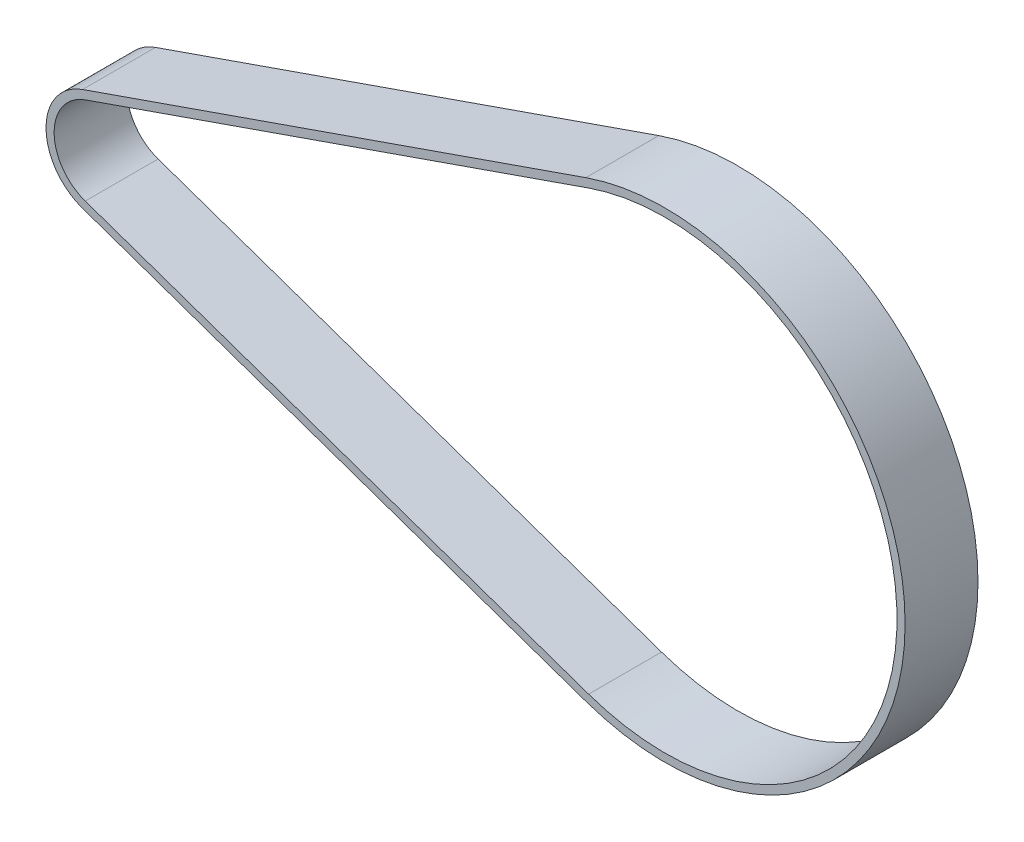
ISO-10303-21;
HEADER;
FILE_DESCRIPTION(('STEP AP214'),'2;1');
FILE_NAME('part.step','',(''),(''),'','','');
FILE_SCHEMA(('AUTOMOTIVE_DESIGN { 1 0 10303 214 1 1 1 1 }'));
ENDSEC;
DATA;
#1=APPLICATION_CONTEXT('core data for automotive mechanical design processes');
#2=APPLICATION_PROTOCOL_DEFINITION('international standard','automotive_design',2000,#1);
#3=PRODUCT_CONTEXT('',#1,'mechanical');
#4=PRODUCT('Part','Part','',(#3));
#5=PRODUCT_RELATED_PRODUCT_CATEGORY('part','',(#4));
#6=PRODUCT_DEFINITION_FORMATION('','',#4);
#7=PRODUCT_DEFINITION_CONTEXT('part definition',#1,'design');
#8=PRODUCT_DEFINITION('design','',#6,#7);
#9=PRODUCT_DEFINITION_SHAPE('','',#8);
#10=(LENGTH_UNIT() NAMED_UNIT(*) SI_UNIT(.MILLI.,.METRE.));
#11=(NAMED_UNIT(*) PLANE_ANGLE_UNIT() SI_UNIT($,.RADIAN.));
#12=(NAMED_UNIT(*) SI_UNIT($,.STERADIAN.) SOLID_ANGLE_UNIT());
#13=UNCERTAINTY_MEASURE_WITH_UNIT(LENGTH_MEASURE(1.E-05),#10,'distance_accuracy_value','');
#14=(GEOMETRIC_REPRESENTATION_CONTEXT(3) GLOBAL_UNCERTAINTY_ASSIGNED_CONTEXT((#13)) GLOBAL_UNIT_ASSIGNED_CONTEXT((#10,
#11,#12)) REPRESENTATION_CONTEXT('',''));
#15=CARTESIAN_POINT('',(0.,0.,0.));
#16=DIRECTION('',(0.,0.,1.));
#17=DIRECTION('',(1.,0.,0.));
#18=AXIS2_PLACEMENT_3D('',#15,#16,#17);
#19=CARTESIAN_POINT('',(-34.8450538472152,0.,9.));
#20=DIRECTION('',(0.,0.,1.));
#21=DIRECTION('',(1.,0.,0.));
#22=AXIS2_PLACEMENT_3D('',#19,#20,#21);
#23=PLANE('',#22);
#24=CARTESIAN_POINT('',(-34.8450538472152,0.,9.));
#25=DIRECTION('',(0.,0.,1.));
#26=DIRECTION('',(1.,0.,0.));
#27=AXIS2_PLACEMENT_3D('',#24,#25,#26);
#28=CIRCLE('',#27,6.72957795130823);
#29=CARTESIAN_POINT('',(-37.0584647235974,6.35515788120541,9.));
#30=VERTEX_POINT('',#29);
#31=CARTESIAN_POINT('',(-37.0584647235974,-6.35515788120538,9.));
#32=VERTEX_POINT('',#31);
#33=EDGE_CURVE('E133',#30,#32,#28,.T.);
#34=ORIENTED_EDGE('',*,*,#33,.T.);
#35=DIRECTION('',(0.944362027929248,-0.328907829346397,0.));
#36=VECTOR('',#35,1.);
#37=CARTESIAN_POINT('',(25.0925420176994,-28.0014673625357,9.));
#38=LINE('',#37,#36);
#39=CARTESIAN_POINT('',(25.0925420176993,-28.0014673625357,9.));
#40=VERTEX_POINT('',#39);
#41=EDGE_CURVE('E136',#32,#40,#38,.T.);
#42=ORIENTED_EDGE('',*,*,#41,.T.);
#43=CARTESIAN_POINT('',(34.8450538472152,0.,9.));
#44=DIRECTION('',(0.,0.,1.));
#45=DIRECTION('',(1.,0.,0.));
#46=AXIS2_PLACEMENT_3D('',#43,#44,#45);
#47=CIRCLE('',#46,29.6512);
#48=CARTESIAN_POINT('',(25.0925420176994,28.0014673625357,9.));
#49=VERTEX_POINT('',#48);
#50=EDGE_CURVE('E139',#40,#49,#47,.T.);
#51=ORIENTED_EDGE('',*,*,#50,.T.);
#52=DIRECTION('',(-0.944362027929248,-0.328907829346397,0.));
#53=VECTOR('',#52,1.);
#54=CARTESIAN_POINT('',(-37.0584647235974,6.35515788120541,9.));
#55=LINE('',#54,#53);
#56=EDGE_CURVE('E141',#49,#30,#55,.T.);
#57=ORIENTED_EDGE('',*,*,#56,.T.);
#58=EDGE_LOOP('',(#34,#42,#51,#57));
#59=FACE_BOUND('',#58,.T.);
#60=DIRECTION('',(0.944362027929248,-0.328907829346397,0.));
#61=VECTOR('',#60,1.);
#62=CARTESIAN_POINT('',(25.4214498470457,-27.0571053346065,9.));
#63=LINE('',#62,#61);
#64=CARTESIAN_POINT('',(-36.729556894251,-5.41079585327614,9.));
#65=VERTEX_POINT('',#64);
#66=CARTESIAN_POINT('',(25.4214498470457,-27.0571053346065,9.));
#67=VERTEX_POINT('',#66);
#68=EDGE_CURVE('E105',#65,#67,#63,.T.);
#69=ORIENTED_EDGE('',*,*,#68,.F.);
#70=CARTESIAN_POINT('',(-34.8450538472152,0.,9.));
#71=DIRECTION('',(0.,0.,1.));
#72=DIRECTION('',(1.,0.,0.));
#73=AXIS2_PLACEMENT_3D('',#70,#71,#72);
#74=CIRCLE('',#73,5.72957795130823);
#75=CARTESIAN_POINT('',(-36.729556894251,5.41079585327616,9.));
#76=VERTEX_POINT('',#75);
#77=EDGE_CURVE('E97',#76,#65,#74,.T.);
#78=ORIENTED_EDGE('',*,*,#77,.F.);
#79=DIRECTION('',(-0.944362027929248,-0.328907829346397,0.));
#80=VECTOR('',#79,1.);
#81=CARTESIAN_POINT('',(-36.729556894251,5.41079585327616,9.));
#82=LINE('',#81,#80);
#83=CARTESIAN_POINT('',(25.4214498470458,27.0571053346065,9.));
#84=VERTEX_POINT('',#83);
#85=EDGE_CURVE('E119',#84,#76,#82,.T.);
#86=ORIENTED_EDGE('',*,*,#85,.F.);
#87=CARTESIAN_POINT('',(34.8450538472152,0.,9.));
#88=DIRECTION('',(0.,0.,1.));
#89=DIRECTION('',(1.,0.,0.));
#90=AXIS2_PLACEMENT_3D('',#87,#88,#89);
#91=CIRCLE('',#90,28.6512);
#92=EDGE_CURVE('E117',#67,#84,#91,.T.);
#93=ORIENTED_EDGE('',*,*,#92,.F.);
#94=EDGE_LOOP('',(#69,#78,#86,#93));
#95=FACE_BOUND('',#94,.T.);
#96=ADVANCED_FACE('F32',(#59,#95),#23,.T.);
#97=CARTESIAN_POINT('',(-34.8450538472152,0.,0.));
#98=DIRECTION('',(0.,0.,1.));
#99=DIRECTION('',(1.,0.,0.));
#100=AXIS2_PLACEMENT_3D('',#97,#98,#99);
#101=PLANE('',#100);
#102=CARTESIAN_POINT('',(-34.8450538472152,0.,0.));
#103=DIRECTION('',(0.,0.,1.));
#104=DIRECTION('',(1.,0.,0.));
#105=AXIS2_PLACEMENT_3D('',#102,#103,#104);
#106=CIRCLE('',#105,6.72957795130823);
#107=CARTESIAN_POINT('',(-37.0584647235974,6.35515788120541,0.));
#108=VERTEX_POINT('',#107);
#109=CARTESIAN_POINT('',(-37.0584647235974,-6.35515788120538,0.));
#110=VERTEX_POINT('',#109);
#111=EDGE_CURVE('E113',#108,#110,#106,.T.);
#112=ORIENTED_EDGE('',*,*,#111,.F.);
#113=DIRECTION('',(-0.944362027929248,-0.328907829346397,0.));
#114=VECTOR('',#113,1.);
#115=CARTESIAN_POINT('',(-37.0584647235974,6.35515788120541,0.));
#116=LINE('',#115,#114);
#117=CARTESIAN_POINT('',(25.0925420176994,28.0014673625357,0.));
#118=VERTEX_POINT('',#117);
#119=EDGE_CURVE('E137',#118,#108,#116,.T.);
#120=ORIENTED_EDGE('',*,*,#119,.F.);
#121=CARTESIAN_POINT('',(34.8450538472152,0.,0.));
#122=DIRECTION('',(0.,0.,1.));
#123=DIRECTION('',(1.,0.,0.));
#124=AXIS2_PLACEMENT_3D('',#121,#122,#123);
#125=CIRCLE('',#124,29.6512);
#126=CARTESIAN_POINT('',(25.0925420176993,-28.0014673625357,0.));
#127=VERTEX_POINT('',#126);
#128=EDGE_CURVE('E148',#127,#118,#125,.T.);
#129=ORIENTED_EDGE('',*,*,#128,.F.);
#130=DIRECTION('',(0.944362027929248,-0.328907829346397,0.));
#131=VECTOR('',#130,1.);
#132=CARTESIAN_POINT('',(25.0925420176994,-28.0014673625357,0.));
#133=LINE('',#132,#131);
#134=EDGE_CURVE('E146',#110,#127,#133,.T.);
#135=ORIENTED_EDGE('',*,*,#134,.F.);
#136=EDGE_LOOP('',(#112,#120,#129,#135));
#137=FACE_BOUND('',#136,.T.);
#138=CARTESIAN_POINT('',(-34.8450538472152,0.,0.));
#139=DIRECTION('',(0.,0.,1.));
#140=DIRECTION('',(1.,0.,0.));
#141=AXIS2_PLACEMENT_3D('',#138,#139,#140);
#142=CIRCLE('',#141,5.72957795130823);
#143=CARTESIAN_POINT('',(-36.729556894251,5.41079585327616,0.));
#144=VERTEX_POINT('',#143);
#145=CARTESIAN_POINT('',(-36.729556894251,-5.41079585327614,0.));
#146=VERTEX_POINT('',#145);
#147=EDGE_CURVE('E55',#144,#146,#142,.T.);
#148=ORIENTED_EDGE('',*,*,#147,.T.);
#149=DIRECTION('',(0.944362027929248,-0.328907829346397,0.));
#150=VECTOR('',#149,1.);
#151=CARTESIAN_POINT('',(25.4214498470457,-27.0571053346065,0.));
#152=LINE('',#151,#150);
#153=CARTESIAN_POINT('',(25.4214498470457,-27.0571053346065,0.));
#154=VERTEX_POINT('',#153);
#155=EDGE_CURVE('E112',#146,#154,#152,.T.);
#156=ORIENTED_EDGE('',*,*,#155,.T.);
#157=CARTESIAN_POINT('',(34.8450538472152,0.,0.));
#158=DIRECTION('',(0.,0.,1.));
#159=DIRECTION('',(1.,0.,0.));
#160=AXIS2_PLACEMENT_3D('',#157,#158,#159);
#161=CIRCLE('',#160,28.6512);
#162=CARTESIAN_POINT('',(25.4214498470458,27.0571053346065,0.));
#163=VERTEX_POINT('',#162);
#164=EDGE_CURVE('E125',#154,#163,#161,.T.);
#165=ORIENTED_EDGE('',*,*,#164,.T.);
#166=DIRECTION('',(-0.944362027929248,-0.328907829346397,0.));
#167=VECTOR('',#166,1.);
#168=CARTESIAN_POINT('',(-36.729556894251,5.41079585327616,0.));
#169=LINE('',#168,#167);
#170=EDGE_CURVE('E106',#163,#144,#169,.T.);
#171=ORIENTED_EDGE('',*,*,#170,.T.);
#172=EDGE_LOOP('',(#148,#156,#165,#171));
#173=FACE_BOUND('',#172,.T.);
#174=ADVANCED_FACE('F166',(#137,#173),#101,.F.);
#175=CARTESIAN_POINT('',(-34.8450538472152,0.,9.));
#176=DIRECTION('',(0.,0.,-1.));
#177=DIRECTION('',(-1.,0.,0.));
#178=AXIS2_PLACEMENT_3D('',#175,#176,#177);
#179=CYLINDRICAL_SURFACE('',#178,6.72957795130823);
#180=ORIENTED_EDGE('',*,*,#111,.T.);
#181=DIRECTION('',(0.,0.,-1.));
#182=VECTOR('',#181,1.);
#183=CARTESIAN_POINT('',(-37.0584647235974,-6.35515788120538,9.));
#184=LINE('',#183,#182);
#185=EDGE_CURVE('E11',#32,#110,#184,.T.);
#186=ORIENTED_EDGE('',*,*,#185,.F.);
#187=ORIENTED_EDGE('',*,*,#33,.F.);
#188=DIRECTION('',(0.,0.,-1.));
#189=VECTOR('',#188,1.);
#190=CARTESIAN_POINT('',(-37.0584647235974,6.35515788120541,9.));
#191=LINE('',#190,#189);
#192=EDGE_CURVE('E143',#30,#108,#191,.T.);
#193=ORIENTED_EDGE('',*,*,#192,.T.);
#194=EDGE_LOOP('',(#180,#186,#187,#193));
#195=FACE_BOUND('',#194,.T.);
#196=ADVANCED_FACE('F34',(#195),#179,.T.);
#197=CARTESIAN_POINT('',(25.0925420176994,-28.0014673625357,9.));
#198=DIRECTION('',(0.328907829346397,0.944362027929248,0.));
#199=DIRECTION('',(-0.944362027929248,0.328907829346397,0.));
#200=AXIS2_PLACEMENT_3D('',#197,#198,#199);
#201=PLANE('',#200);
#202=ORIENTED_EDGE('',*,*,#134,.T.);
#203=DIRECTION('',(0.,0.,-1.));
#204=VECTOR('',#203,1.);
#205=CARTESIAN_POINT('',(25.0925420176993,-28.0014673625357,9.));
#206=LINE('',#205,#204);
#207=EDGE_CURVE('E40',#40,#127,#206,.T.);
#208=ORIENTED_EDGE('',*,*,#207,.F.);
#209=ORIENTED_EDGE('',*,*,#41,.F.);
#210=ORIENTED_EDGE('',*,*,#185,.T.);
#211=EDGE_LOOP('',(#202,#208,#209,#210));
#212=FACE_BOUND('',#211,.T.);
#213=ADVANCED_FACE('F176',(#212),#201,.F.);
#214=CARTESIAN_POINT('',(34.8450538472152,0.,9.));
#215=DIRECTION('',(0.,0.,-1.));
#216=DIRECTION('',(-1.,0.,0.));
#217=AXIS2_PLACEMENT_3D('',#214,#215,#216);
#218=CYLINDRICAL_SURFACE('',#217,29.6512);
#219=ORIENTED_EDGE('',*,*,#128,.T.);
#220=DIRECTION('',(0.,0.,-1.));
#221=VECTOR('',#220,1.);
#222=CARTESIAN_POINT('',(25.0925420176994,28.0014673625357,9.));
#223=LINE('',#222,#221);
#224=EDGE_CURVE('E153',#49,#118,#223,.T.);
#225=ORIENTED_EDGE('',*,*,#224,.F.);
#226=ORIENTED_EDGE('',*,*,#50,.F.);
#227=ORIENTED_EDGE('',*,*,#207,.T.);
#228=EDGE_LOOP('',(#219,#225,#226,#227));
#229=FACE_BOUND('',#228,.T.);
#230=ADVANCED_FACE('F160',(#229),#218,.T.);
#231=CARTESIAN_POINT('',(-37.0584647235974,6.35515788120541,9.));
#232=DIRECTION('',(0.328907829346397,-0.944362027929248,0.));
#233=DIRECTION('',(0.944362027929248,0.328907829346397,0.));
#234=AXIS2_PLACEMENT_3D('',#231,#232,#233);
#235=PLANE('',#234);
#236=ORIENTED_EDGE('',*,*,#119,.T.);
#237=ORIENTED_EDGE('',*,*,#192,.F.);
#238=ORIENTED_EDGE('',*,*,#56,.F.);
#239=ORIENTED_EDGE('',*,*,#224,.T.);
#240=EDGE_LOOP('',(#236,#237,#238,#239));
#241=FACE_BOUND('',#240,.T.);
#242=ADVANCED_FACE('F170',(#241),#235,.F.);
#243=CARTESIAN_POINT('',(-34.8450538472152,0.,9.));
#244=DIRECTION('',(0.,0.,-1.));
#245=DIRECTION('',(-1.,0.,0.));
#246=AXIS2_PLACEMENT_3D('',#243,#244,#245);
#247=CYLINDRICAL_SURFACE('',#246,5.72957795130823);
#248=ORIENTED_EDGE('',*,*,#147,.F.);
#249=DIRECTION('',(0.,0.,-1.));
#250=VECTOR('',#249,1.);
#251=CARTESIAN_POINT('',(-36.729556894251,5.41079585327616,9.));
#252=LINE('',#251,#250);
#253=EDGE_CURVE('E101',#76,#144,#252,.T.);
#254=ORIENTED_EDGE('',*,*,#253,.F.);
#255=ORIENTED_EDGE('',*,*,#77,.T.);
#256=DIRECTION('',(0.,0.,-1.));
#257=VECTOR('',#256,1.);
#258=CARTESIAN_POINT('',(-36.729556894251,-5.41079585327614,9.));
#259=LINE('',#258,#257);
#260=EDGE_CURVE('E100',#65,#146,#259,.T.);
#261=ORIENTED_EDGE('',*,*,#260,.T.);
#262=EDGE_LOOP('',(#248,#254,#255,#261));
#263=FACE_BOUND('',#262,.T.);
#264=ADVANCED_FACE('F99',(#263),#247,.F.);
#265=CARTESIAN_POINT('',(25.4214498470457,-27.0571053346065,9.));
#266=DIRECTION('',(0.328907829346397,0.944362027929248,0.));
#267=DIRECTION('',(-0.944362027929248,0.328907829346397,0.));
#268=AXIS2_PLACEMENT_3D('',#265,#266,#267);
#269=PLANE('',#268);
#270=ORIENTED_EDGE('',*,*,#155,.F.);
#271=ORIENTED_EDGE('',*,*,#260,.F.);
#272=ORIENTED_EDGE('',*,*,#68,.T.);
#273=DIRECTION('',(0.,0.,-1.));
#274=VECTOR('',#273,1.);
#275=CARTESIAN_POINT('',(25.4214498470457,-27.0571053346065,9.));
#276=LINE('',#275,#274);
#277=EDGE_CURVE('E114',#67,#154,#276,.T.);
#278=ORIENTED_EDGE('',*,*,#277,.T.);
#279=EDGE_LOOP('',(#270,#271,#272,#278));
#280=FACE_BOUND('',#279,.T.);
#281=ADVANCED_FACE('F109',(#280),#269,.T.);
#282=CARTESIAN_POINT('',(34.8450538472152,0.,9.));
#283=DIRECTION('',(0.,0.,-1.));
#284=DIRECTION('',(-1.,0.,0.));
#285=AXIS2_PLACEMENT_3D('',#282,#283,#284);
#286=CYLINDRICAL_SURFACE('',#285,28.6512);
#287=ORIENTED_EDGE('',*,*,#164,.F.);
#288=ORIENTED_EDGE('',*,*,#277,.F.);
#289=ORIENTED_EDGE('',*,*,#92,.T.);
#290=DIRECTION('',(0.,0.,-1.));
#291=VECTOR('',#290,1.);
#292=CARTESIAN_POINT('',(25.4214498470458,27.0571053346065,9.));
#293=LINE('',#292,#291);
#294=EDGE_CURVE('E47',#84,#163,#293,.T.);
#295=ORIENTED_EDGE('',*,*,#294,.T.);
#296=EDGE_LOOP('',(#287,#288,#289,#295));
#297=FACE_BOUND('',#296,.T.);
#298=ADVANCED_FACE('F199',(#297),#286,.F.);
#299=CARTESIAN_POINT('',(-36.729556894251,5.41079585327616,9.));
#300=DIRECTION('',(0.328907829346397,-0.944362027929248,0.));
#301=DIRECTION('',(0.944362027929248,0.328907829346397,0.));
#302=AXIS2_PLACEMENT_3D('',#299,#300,#301);
#303=PLANE('',#302);
#304=ORIENTED_EDGE('',*,*,#170,.F.);
#305=ORIENTED_EDGE('',*,*,#294,.F.);
#306=ORIENTED_EDGE('',*,*,#85,.T.);
#307=ORIENTED_EDGE('',*,*,#253,.T.);
#308=EDGE_LOOP('',(#304,#305,#306,#307));
#309=FACE_BOUND('',#308,.T.);
#310=ADVANCED_FACE('F203',(#309),#303,.T.);
#311=CLOSED_SHELL('',(#96,#174,#196,#213,#230,#242,#264,#281,#298,#310));
#312=MANIFOLD_SOLID_BREP('B2',#311);
#313=ADVANCED_BREP_SHAPE_REPRESENTATION('',(#18,#312),#14);
#314=SHAPE_DEFINITION_REPRESENTATION(#9,#313);
ENDSEC;
END-ISO-10303-21;
